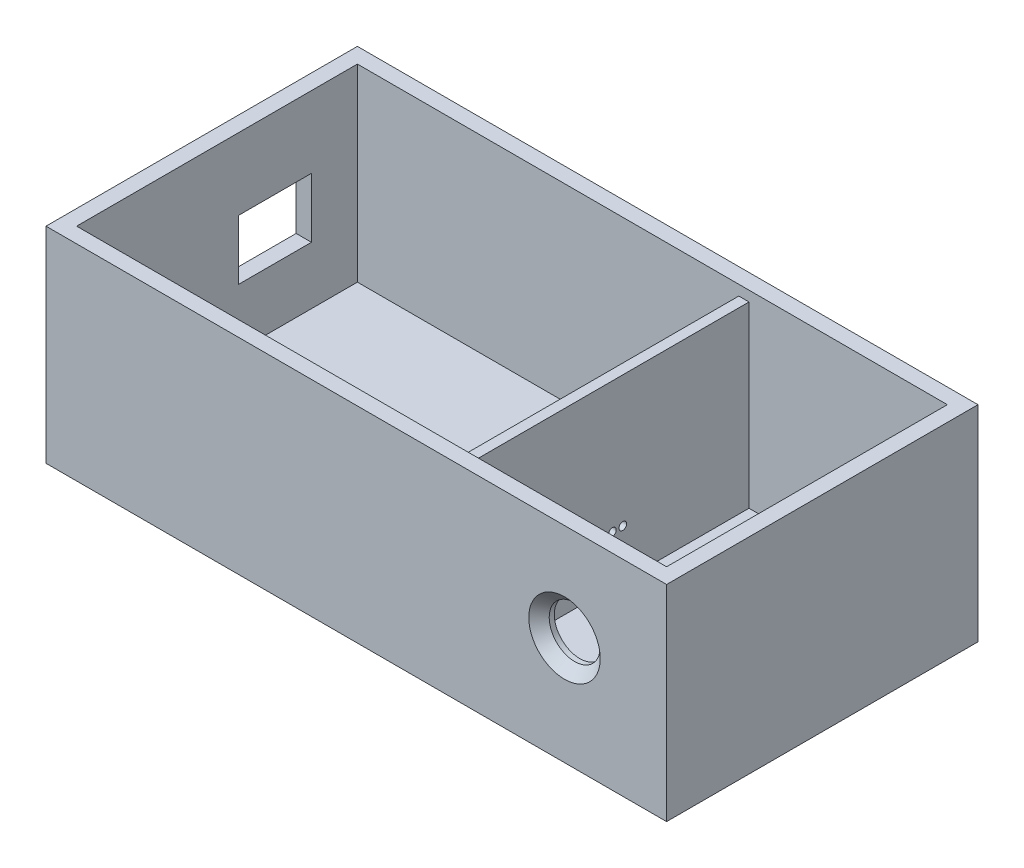
ISO-10303-21;
HEADER;
FILE_DESCRIPTION(('STEP AP214'),'2;1');
FILE_NAME('part.step','',(''),(''),'','','');
FILE_SCHEMA(('AUTOMOTIVE_DESIGN { 1 0 10303 214 1 1 1 1 }'));
ENDSEC;
DATA;
#1=APPLICATION_CONTEXT('core data for automotive mechanical design processes');
#2=APPLICATION_PROTOCOL_DEFINITION('international standard','automotive_design',2000,#1);
#3=PRODUCT_CONTEXT('',#1,'mechanical');
#4=PRODUCT('Part','Part','',(#3));
#5=PRODUCT_RELATED_PRODUCT_CATEGORY('part','',(#4));
#6=PRODUCT_DEFINITION_FORMATION('','',#4);
#7=PRODUCT_DEFINITION_CONTEXT('part definition',#1,'design');
#8=PRODUCT_DEFINITION('design','',#6,#7);
#9=PRODUCT_DEFINITION_SHAPE('','',#8);
#10=(LENGTH_UNIT() NAMED_UNIT(*) SI_UNIT(.MILLI.,.METRE.));
#11=(NAMED_UNIT(*) PLANE_ANGLE_UNIT() SI_UNIT($,.RADIAN.));
#12=(NAMED_UNIT(*) SI_UNIT($,.STERADIAN.) SOLID_ANGLE_UNIT());
#13=UNCERTAINTY_MEASURE_WITH_UNIT(LENGTH_MEASURE(1.E-05),#10,'distance_accuracy_value','');
#14=(GEOMETRIC_REPRESENTATION_CONTEXT(3) GLOBAL_UNCERTAINTY_ASSIGNED_CONTEXT((#13)) GLOBAL_UNIT_ASSIGNED_CONTEXT((#10,
#11,#12)) REPRESENTATION_CONTEXT('',''));
#15=CARTESIAN_POINT('',(0.,0.,0.));
#16=DIRECTION('',(0.,0.,1.));
#17=DIRECTION('',(1.,0.,0.));
#18=AXIS2_PLACEMENT_3D('',#15,#16,#17);
#19=CARTESIAN_POINT('',(-57.785,40.2353694330568,27.5));
#20=DIRECTION('',(0.,0.,-1.));
#21=DIRECTION('',(-1.,0.,0.));
#22=AXIS2_PLACEMENT_3D('',#19,#20,#21);
#23=PLANE('',#22);
#24=CARTESIAN_POINT('',(40.785,21.15,27.5));
#25=DIRECTION('',(0.,0.,-1.));
#26=DIRECTION('',(-1.,0.,0.));
#27=AXIS2_PLACEMENT_3D('',#24,#25,#26);
#28=CIRCLE('',#27,5.);
#29=CARTESIAN_POINT('',(35.785,21.15,27.5));
#30=VERTEX_POINT('',#29);
#31=EDGE_CURVE('E325',#30,#30,#28,.T.);
#32=ORIENTED_EDGE('',*,*,#31,.F.);
#33=EDGE_LOOP('',(#32));
#34=FACE_BOUND('',#33,.T.);
#35=DIRECTION('',(-1.,0.,0.));
#36=VECTOR('',#35,1.);
#37=CARTESIAN_POINT('',(18.9299999999998,38.2353694330568,27.5));
#38=LINE('',#37,#36);
#39=CARTESIAN_POINT('',(18.9299999999998,38.2353694330568,27.5));
#40=VERTEX_POINT('',#39);
#41=CARTESIAN_POINT('',(16.9299999999997,38.2353694330568,27.5));
#42=VERTEX_POINT('',#41);
#43=EDGE_CURVE('E302',#40,#42,#38,.T.);
#44=ORIENTED_EDGE('',*,*,#43,.T.);
#45=DIRECTION('',(0.,-1.,0.));
#46=VECTOR('',#45,1.);
#47=CARTESIAN_POINT('',(16.9299999999997,38.2353694330568,27.5));
#48=LINE('',#47,#46);
#49=CARTESIAN_POINT('',(16.9299999999997,3.23536943305684,27.5));
#50=VERTEX_POINT('',#49);
#51=EDGE_CURVE('E138',#42,#50,#48,.T.);
#52=ORIENTED_EDGE('',*,*,#51,.T.);
#53=DIRECTION('',(1.,0.,0.));
#54=VECTOR('',#53,1.);
#55=CARTESIAN_POINT('',(-57.785,3.23536943305684,27.5));
#56=LINE('',#55,#54);
#57=CARTESIAN_POINT('',(-57.785,3.23536943305684,27.5));
#58=VERTEX_POINT('',#57);
#59=EDGE_CURVE('E233',#58,#50,#56,.T.);
#60=ORIENTED_EDGE('',*,*,#59,.F.);
#61=DIRECTION('',(0.,-1.,0.));
#62=VECTOR('',#61,1.);
#63=CARTESIAN_POINT('',(-57.785,40.2353694330568,27.5));
#64=LINE('',#63,#62);
#65=CARTESIAN_POINT('',(-57.785,40.2353694330568,27.5));
#66=VERTEX_POINT('',#65);
#67=EDGE_CURVE('E215',#66,#58,#64,.T.);
#68=ORIENTED_EDGE('',*,*,#67,.F.);
#69=DIRECTION('',(1.,0.,0.));
#70=VECTOR('',#69,1.);
#71=CARTESIAN_POINT('',(-57.785,40.2353694330568,27.5));
#72=LINE('',#71,#70);
#73=CARTESIAN_POINT('',(57.785,40.2353694330568,27.5));
#74=VERTEX_POINT('',#73);
#75=EDGE_CURVE('E127',#66,#74,#72,.T.);
#76=ORIENTED_EDGE('',*,*,#75,.T.);
#77=DIRECTION('',(0.,-1.,0.));
#78=VECTOR('',#77,1.);
#79=CARTESIAN_POINT('',(57.785,40.2353694330568,27.5));
#80=LINE('',#79,#78);
#81=CARTESIAN_POINT('',(57.785,3.23536943305684,27.5));
#82=VERTEX_POINT('',#81);
#83=EDGE_CURVE('E221',#74,#82,#80,.T.);
#84=ORIENTED_EDGE('',*,*,#83,.T.);
#85=CARTESIAN_POINT('',(18.9299999999998,3.23536943305684,27.5));
#86=VERTEX_POINT('',#85);
#87=EDGE_CURVE('E240',#86,#82,#56,.T.);
#88=ORIENTED_EDGE('',*,*,#87,.F.);
#89=DIRECTION('',(0.,-1.,0.));
#90=VECTOR('',#89,1.);
#91=CARTESIAN_POINT('',(18.9299999999998,38.2353694330568,27.5));
#92=LINE('',#91,#90);
#93=EDGE_CURVE('E303',#40,#86,#92,.T.);
#94=ORIENTED_EDGE('',*,*,#93,.F.);
#95=EDGE_LOOP('',(#44,#52,#60,#68,#76,#84,#88,#94));
#96=FACE_BOUND('',#95,.T.);
#97=ADVANCED_FACE('F47',(#34,#96),#23,.T.);
#98=CARTESIAN_POINT('',(57.785,40.2353694330568,-27.5));
#99=DIRECTION('',(0.,0.,1.));
#100=DIRECTION('',(1.,0.,0.));
#101=AXIS2_PLACEMENT_3D('',#98,#99,#100);
#102=PLANE('',#101);
#103=DIRECTION('',(-1.,0.,0.));
#104=VECTOR('',#103,1.);
#105=CARTESIAN_POINT('',(57.785,3.23536943305684,-27.5));
#106=LINE('',#105,#104);
#107=CARTESIAN_POINT('',(16.9299999999997,3.23536943305684,-27.5));
#108=VERTEX_POINT('',#107);
#109=CARTESIAN_POINT('',(-57.785,3.23536943305684,-27.5));
#110=VERTEX_POINT('',#109);
#111=EDGE_CURVE('E237',#108,#110,#106,.T.);
#112=ORIENTED_EDGE('',*,*,#111,.F.);
#113=DIRECTION('',(0.,-1.,0.));
#114=VECTOR('',#113,1.);
#115=CARTESIAN_POINT('',(16.9299999999997,38.2353694330568,-27.5));
#116=LINE('',#115,#114);
#117=CARTESIAN_POINT('',(16.9299999999997,38.2353694330568,-27.5));
#118=VERTEX_POINT('',#117);
#119=EDGE_CURVE('E295',#118,#108,#116,.T.);
#120=ORIENTED_EDGE('',*,*,#119,.F.);
#121=DIRECTION('',(-1.,0.,0.));
#122=VECTOR('',#121,1.);
#123=CARTESIAN_POINT('',(18.9299999999997,38.2353694330568,-27.5));
#124=LINE('',#123,#122);
#125=CARTESIAN_POINT('',(18.9299999999998,38.2353694330568,-27.5));
#126=VERTEX_POINT('',#125);
#127=EDGE_CURVE('E307',#126,#118,#124,.T.);
#128=ORIENTED_EDGE('',*,*,#127,.F.);
#129=DIRECTION('',(0.,-1.,0.));
#130=VECTOR('',#129,1.);
#131=CARTESIAN_POINT('',(18.9299999999997,38.2353694330568,-27.5));
#132=LINE('',#131,#130);
#133=CARTESIAN_POINT('',(18.9299999999997,3.23536943305684,-27.5));
#134=VERTEX_POINT('',#133);
#135=EDGE_CURVE('E224',#126,#134,#132,.T.);
#136=ORIENTED_EDGE('',*,*,#135,.T.);
#137=CARTESIAN_POINT('',(57.785,3.23536943305684,-27.5));
#138=VERTEX_POINT('',#137);
#139=EDGE_CURVE('E101',#138,#134,#106,.T.);
#140=ORIENTED_EDGE('',*,*,#139,.F.);
#141=DIRECTION('',(0.,-1.,0.));
#142=VECTOR('',#141,1.);
#143=CARTESIAN_POINT('',(57.785,40.2353694330568,-27.5));
#144=LINE('',#143,#142);
#145=CARTESIAN_POINT('',(57.785,40.2353694330568,-27.5));
#146=VERTEX_POINT('',#145);
#147=EDGE_CURVE('E225',#146,#138,#144,.T.);
#148=ORIENTED_EDGE('',*,*,#147,.F.);
#149=DIRECTION('',(-1.,0.,0.));
#150=VECTOR('',#149,1.);
#151=CARTESIAN_POINT('',(57.785,40.2353694330568,-27.5));
#152=LINE('',#151,#150);
#153=CARTESIAN_POINT('',(-57.785,40.2353694330568,-27.5));
#154=VERTEX_POINT('',#153);
#155=EDGE_CURVE('E234',#146,#154,#152,.T.);
#156=ORIENTED_EDGE('',*,*,#155,.T.);
#157=DIRECTION('',(0.,-1.,0.));
#158=VECTOR('',#157,1.);
#159=CARTESIAN_POINT('',(-57.785,40.2353694330568,-27.5));
#160=LINE('',#159,#158);
#161=EDGE_CURVE('E229',#154,#110,#160,.T.);
#162=ORIENTED_EDGE('',*,*,#161,.T.);
#163=EDGE_LOOP('',(#112,#120,#128,#136,#140,#148,#156,#162));
#164=FACE_BOUND('',#163,.T.);
#165=ADVANCED_FACE('F420',(#164),#102,.T.);
#166=CARTESIAN_POINT('',(0.,3.23536943305684,0.));
#167=DIRECTION('',(0.,1.,0.));
#168=DIRECTION('',(0.,0.,1.));
#169=AXIS2_PLACEMENT_3D('',#166,#167,#168);
#170=PLANE('',#169);
#171=ORIENTED_EDGE('',*,*,#59,.T.);
#172=DIRECTION('',(0.,0.,1.));
#173=VECTOR('',#172,1.);
#174=CARTESIAN_POINT('',(16.9299999999997,3.23536943305684,-27.5));
#175=LINE('',#174,#173);
#176=EDGE_CURVE('E287',#108,#50,#175,.T.);
#177=ORIENTED_EDGE('',*,*,#176,.F.);
#178=ORIENTED_EDGE('',*,*,#111,.T.);
#179=DIRECTION('',(0.,0.,1.));
#180=VECTOR('',#179,1.);
#181=CARTESIAN_POINT('',(-57.785,3.23536943305684,-27.5));
#182=LINE('',#181,#180);
#183=EDGE_CURVE('E243',#110,#58,#182,.T.);
#184=ORIENTED_EDGE('',*,*,#183,.T.);
#185=EDGE_LOOP('',(#171,#177,#178,#184));
#186=FACE_BOUND('',#185,.T.);
#187=ADVANCED_FACE('F417',(#186),#170,.T.);
#188=CARTESIAN_POINT('',(60.785,3.23536943305684,-30.5));
#189=DIRECTION('',(-1.,0.,0.));
#190=DIRECTION('',(0.,0.,1.));
#191=AXIS2_PLACEMENT_3D('',#188,#189,#190);
#192=PLANE('',#191);
#193=DIRECTION('',(0.,0.,-1.));
#194=VECTOR('',#193,1.);
#195=CARTESIAN_POINT('',(60.785,0.,-30.5));
#196=LINE('',#195,#194);
#197=CARTESIAN_POINT('',(60.785,0.,30.5));
#198=VERTEX_POINT('',#197);
#199=CARTESIAN_POINT('',(60.785,0.,-30.5));
#200=VERTEX_POINT('',#199);
#201=EDGE_CURVE('E183',#198,#200,#196,.T.);
#202=ORIENTED_EDGE('',*,*,#201,.T.);
#203=DIRECTION('',(0.,-1.,0.));
#204=VECTOR('',#203,1.);
#205=CARTESIAN_POINT('',(60.785,3.23536943305684,-30.5));
#206=LINE('',#205,#204);
#207=CARTESIAN_POINT('',(60.785,40.2353694330568,-30.5));
#208=VERTEX_POINT('',#207);
#209=EDGE_CURVE('E176',#208,#200,#206,.T.);
#210=ORIENTED_EDGE('',*,*,#209,.F.);
#211=DIRECTION('',(0.,0.,-1.));
#212=VECTOR('',#211,1.);
#213=CARTESIAN_POINT('',(60.785,40.2353694330568,30.5));
#214=LINE('',#213,#212);
#215=CARTESIAN_POINT('',(60.785,40.2353694330568,30.5));
#216=VERTEX_POINT('',#215);
#217=EDGE_CURVE('E180',#216,#208,#214,.T.);
#218=ORIENTED_EDGE('',*,*,#217,.F.);
#219=DIRECTION('',(0.,-1.,0.));
#220=VECTOR('',#219,1.);
#221=CARTESIAN_POINT('',(60.785,3.23536943305684,30.5));
#222=LINE('',#221,#220);
#223=EDGE_CURVE('E375',#216,#198,#222,.T.);
#224=ORIENTED_EDGE('',*,*,#223,.T.);
#225=EDGE_LOOP('',(#202,#210,#218,#224));
#226=FACE_BOUND('',#225,.T.);
#227=ADVANCED_FACE('F178',(#226),#192,.F.);
#228=CARTESIAN_POINT('',(-60.785,3.23536943305684,-30.5));
#229=DIRECTION('',(0.,0.,1.));
#230=DIRECTION('',(1.,0.,0.));
#231=AXIS2_PLACEMENT_3D('',#228,#229,#230);
#232=PLANE('',#231);
#233=DIRECTION('',(-1.,0.,0.));
#234=VECTOR('',#233,1.);
#235=CARTESIAN_POINT('',(-60.785,0.,-30.5));
#236=LINE('',#235,#234);
#237=CARTESIAN_POINT('',(-60.785,0.,-30.5));
#238=VERTEX_POINT('',#237);
#239=EDGE_CURVE('E188',#200,#238,#236,.T.);
#240=ORIENTED_EDGE('',*,*,#239,.T.);
#241=DIRECTION('',(0.,-1.,0.));
#242=VECTOR('',#241,1.);
#243=CARTESIAN_POINT('',(-60.785,3.23536943305684,-30.5));
#244=LINE('',#243,#242);
#245=CARTESIAN_POINT('',(-60.785,40.2353694330568,-30.5));
#246=VERTEX_POINT('',#245);
#247=EDGE_CURVE('E203',#246,#238,#244,.T.);
#248=ORIENTED_EDGE('',*,*,#247,.F.);
#249=DIRECTION('',(-1.,0.,0.));
#250=VECTOR('',#249,1.);
#251=CARTESIAN_POINT('',(60.785,40.2353694330568,-30.5));
#252=LINE('',#251,#250);
#253=EDGE_CURVE('E195',#208,#246,#252,.T.);
#254=ORIENTED_EDGE('',*,*,#253,.F.);
#255=ORIENTED_EDGE('',*,*,#209,.T.);
#256=EDGE_LOOP('',(#240,#248,#254,#255));
#257=FACE_BOUND('',#256,.T.);
#258=ADVANCED_FACE('F201',(#257),#232,.F.);
#259=CARTESIAN_POINT('',(-60.785,3.23536943305684,-30.5));
#260=DIRECTION('',(1.,0.,0.));
#261=DIRECTION('',(0.,0.,-1.));
#262=AXIS2_PLACEMENT_3D('',#259,#260,#261);
#263=PLANE('',#262);
#264=DIRECTION('',(0.,0.,-1.));
#265=VECTOR('',#264,1.);
#266=CARTESIAN_POINT('',(-60.785,26.2,-18.5));
#267=LINE('',#266,#265);
#268=CARTESIAN_POINT('',(-60.785,26.2,-4.2));
#269=VERTEX_POINT('',#268);
#270=CARTESIAN_POINT('',(-60.785,26.2,-18.5));
#271=VERTEX_POINT('',#270);
#272=EDGE_CURVE('E260',#269,#271,#267,.T.);
#273=ORIENTED_EDGE('',*,*,#272,.F.);
#274=DIRECTION('',(0.,1.,0.));
#275=VECTOR('',#274,1.);
#276=CARTESIAN_POINT('',(-60.785,14.5,-4.2));
#277=LINE('',#276,#275);
#278=CARTESIAN_POINT('',(-60.785,14.5,-4.2));
#279=VERTEX_POINT('',#278);
#280=EDGE_CURVE('E269',#279,#269,#277,.T.);
#281=ORIENTED_EDGE('',*,*,#280,.F.);
#282=DIRECTION('',(0.,0.,1.));
#283=VECTOR('',#282,1.);
#284=CARTESIAN_POINT('',(-60.785,14.5,-18.5));
#285=LINE('',#284,#283);
#286=CARTESIAN_POINT('',(-60.785,14.5,-18.5));
#287=VERTEX_POINT('',#286);
#288=EDGE_CURVE('E265',#287,#279,#285,.T.);
#289=ORIENTED_EDGE('',*,*,#288,.F.);
#290=DIRECTION('',(0.,-1.,0.));
#291=VECTOR('',#290,1.);
#292=CARTESIAN_POINT('',(-60.785,14.5,-18.5));
#293=LINE('',#292,#291);
#294=EDGE_CURVE('E261',#271,#287,#293,.T.);
#295=ORIENTED_EDGE('',*,*,#294,.F.);
#296=EDGE_LOOP('',(#273,#281,#289,#295));
#297=FACE_BOUND('',#296,.T.);
#298=DIRECTION('',(0.,0.,1.));
#299=VECTOR('',#298,1.);
#300=CARTESIAN_POINT('',(-60.785,0.,-30.5));
#301=LINE('',#300,#299);
#302=CARTESIAN_POINT('',(-60.785,0.,30.5));
#303=VERTEX_POINT('',#302);
#304=EDGE_CURVE('E187',#238,#303,#301,.T.);
#305=ORIENTED_EDGE('',*,*,#304,.T.);
#306=DIRECTION('',(0.,-1.,0.));
#307=VECTOR('',#306,1.);
#308=CARTESIAN_POINT('',(-60.785,3.23536943305684,30.5));
#309=LINE('',#308,#307);
#310=CARTESIAN_POINT('',(-60.785,40.2353694330568,30.5));
#311=VERTEX_POINT('',#310);
#312=EDGE_CURVE('E214',#311,#303,#309,.T.);
#313=ORIENTED_EDGE('',*,*,#312,.F.);
#314=DIRECTION('',(0.,0.,1.));
#315=VECTOR('',#314,1.);
#316=CARTESIAN_POINT('',(-60.785,40.2353694330568,-30.5));
#317=LINE('',#316,#315);
#318=EDGE_CURVE('E205',#246,#311,#317,.T.);
#319=ORIENTED_EDGE('',*,*,#318,.F.);
#320=ORIENTED_EDGE('',*,*,#247,.T.);
#321=EDGE_LOOP('',(#305,#313,#319,#320));
#322=FACE_BOUND('',#321,.T.);
#323=ADVANCED_FACE('F464',(#297,#322),#263,.F.);
#324=CARTESIAN_POINT('',(-60.785,3.23536943305684,30.5));
#325=DIRECTION('',(0.,0.,-1.));
#326=DIRECTION('',(-1.,0.,0.));
#327=AXIS2_PLACEMENT_3D('',#324,#325,#326);
#328=PLANE('',#327);
#329=CARTESIAN_POINT('',(40.785,21.15,30.5));
#330=DIRECTION('',(0.,0.,-1.));
#331=DIRECTION('',(-1.,0.,0.));
#332=AXIS2_PLACEMENT_3D('',#329,#330,#331);
#333=CIRCLE('',#332,6.99999999999998);
#334=CARTESIAN_POINT('',(33.785,21.15,30.5));
#335=VERTEX_POINT('',#334);
#336=EDGE_CURVE('E11',#335,#335,#333,.T.);
#337=ORIENTED_EDGE('',*,*,#336,.T.);
#338=EDGE_LOOP('',(#337));
#339=FACE_BOUND('',#338,.T.);
#340=DIRECTION('',(1.,0.,0.));
#341=VECTOR('',#340,1.);
#342=CARTESIAN_POINT('',(-60.785,0.,30.5));
#343=LINE('',#342,#341);
#344=EDGE_CURVE('E371',#303,#198,#343,.T.);
#345=ORIENTED_EDGE('',*,*,#344,.T.);
#346=ORIENTED_EDGE('',*,*,#223,.F.);
#347=DIRECTION('',(1.,0.,0.));
#348=VECTOR('',#347,1.);
#349=CARTESIAN_POINT('',(-60.785,40.2353694330568,30.5));
#350=LINE('',#349,#348);
#351=EDGE_CURVE('E198',#311,#216,#350,.T.);
#352=ORIENTED_EDGE('',*,*,#351,.F.);
#353=ORIENTED_EDGE('',*,*,#312,.T.);
#354=EDGE_LOOP('',(#345,#346,#352,#353));
#355=FACE_BOUND('',#354,.T.);
#356=ADVANCED_FACE('F460',(#339,#355),#328,.F.);
#357=CARTESIAN_POINT('',(0.,0.,0.));
#358=DIRECTION('',(0.,1.,0.));
#359=DIRECTION('',(0.,0.,1.));
#360=AXIS2_PLACEMENT_3D('',#357,#358,#359);
#361=PLANE('',#360);
#362=ORIENTED_EDGE('',*,*,#201,.F.);
#363=ORIENTED_EDGE('',*,*,#344,.F.);
#364=ORIENTED_EDGE('',*,*,#304,.F.);
#365=ORIENTED_EDGE('',*,*,#239,.F.);
#366=EDGE_LOOP('',(#362,#363,#364,#365));
#367=FACE_BOUND('',#366,.T.);
#368=ADVANCED_FACE('F463',(#367),#361,.F.);
#369=CARTESIAN_POINT('',(0.,40.2353694330568,0.));
#370=DIRECTION('',(0.,1.,0.));
#371=DIRECTION('',(0.,0.,1.));
#372=AXIS2_PLACEMENT_3D('',#369,#370,#371);
#373=PLANE('',#372);
#374=ORIENTED_EDGE('',*,*,#351,.T.);
#375=ORIENTED_EDGE('',*,*,#217,.T.);
#376=ORIENTED_EDGE('',*,*,#253,.T.);
#377=ORIENTED_EDGE('',*,*,#318,.T.);
#378=EDGE_LOOP('',(#374,#375,#376,#377));
#379=FACE_BOUND('',#378,.T.);
#380=ORIENTED_EDGE('',*,*,#75,.F.);
#381=DIRECTION('',(0.,0.,1.));
#382=VECTOR('',#381,1.);
#383=CARTESIAN_POINT('',(-57.785,40.2353694330568,-27.5));
#384=LINE('',#383,#382);
#385=EDGE_CURVE('E220',#154,#66,#384,.T.);
#386=ORIENTED_EDGE('',*,*,#385,.F.);
#387=ORIENTED_EDGE('',*,*,#155,.F.);
#388=DIRECTION('',(0.,0.,-1.));
#389=VECTOR('',#388,1.);
#390=CARTESIAN_POINT('',(57.785,40.2353694330568,27.5));
#391=LINE('',#390,#389);
#392=EDGE_CURVE('E219',#74,#146,#391,.T.);
#393=ORIENTED_EDGE('',*,*,#392,.F.);
#394=EDGE_LOOP('',(#380,#386,#387,#393));
#395=FACE_BOUND('',#394,.T.);
#396=ADVANCED_FACE('F192',(#379,#395),#373,.T.);
#397=CARTESIAN_POINT('',(-57.785,40.2353694330568,-27.5));
#398=DIRECTION('',(1.,0.,0.));
#399=DIRECTION('',(0.,0.,-1.));
#400=AXIS2_PLACEMENT_3D('',#397,#398,#399);
#401=PLANE('',#400);
#402=DIRECTION('',(0.,1.,0.));
#403=VECTOR('',#402,1.);
#404=CARTESIAN_POINT('',(-57.785,14.5,-4.2));
#405=LINE('',#404,#403);
#406=CARTESIAN_POINT('',(-57.785,14.5,-4.2));
#407=VERTEX_POINT('',#406);
#408=CARTESIAN_POINT('',(-57.785,26.2,-4.2));
#409=VERTEX_POINT('',#408);
#410=EDGE_CURVE('E208',#407,#409,#405,.T.);
#411=ORIENTED_EDGE('',*,*,#410,.T.);
#412=DIRECTION('',(0.,0.,-1.));
#413=VECTOR('',#412,1.);
#414=CARTESIAN_POINT('',(-57.785,26.2,-18.5));
#415=LINE('',#414,#413);
#416=CARTESIAN_POINT('',(-57.785,26.2,-18.5));
#417=VERTEX_POINT('',#416);
#418=EDGE_CURVE('E68',#409,#417,#415,.T.);
#419=ORIENTED_EDGE('',*,*,#418,.T.);
#420=DIRECTION('',(0.,-1.,0.));
#421=VECTOR('',#420,1.);
#422=CARTESIAN_POINT('',(-57.785,14.5,-18.5));
#423=LINE('',#422,#421);
#424=CARTESIAN_POINT('',(-57.785,14.5,-18.5));
#425=VERTEX_POINT('',#424);
#426=EDGE_CURVE('E272',#417,#425,#423,.T.);
#427=ORIENTED_EDGE('',*,*,#426,.T.);
#428=DIRECTION('',(0.,0.,1.));
#429=VECTOR('',#428,1.);
#430=CARTESIAN_POINT('',(-57.785,14.5,-18.5));
#431=LINE('',#430,#429);
#432=EDGE_CURVE('E256',#425,#407,#431,.T.);
#433=ORIENTED_EDGE('',*,*,#432,.T.);
#434=EDGE_LOOP('',(#411,#419,#427,#433));
#435=FACE_BOUND('',#434,.T.);
#436=ORIENTED_EDGE('',*,*,#183,.F.);
#437=ORIENTED_EDGE('',*,*,#161,.F.);
#438=ORIENTED_EDGE('',*,*,#385,.T.);
#439=ORIENTED_EDGE('',*,*,#67,.T.);
#440=EDGE_LOOP('',(#436,#437,#438,#439));
#441=FACE_BOUND('',#440,.T.);
#442=ADVANCED_FACE('F426',(#435,#441),#401,.T.);
#443=CARTESIAN_POINT('',(57.785,40.2353694330568,27.5));
#444=DIRECTION('',(-1.,0.,0.));
#445=DIRECTION('',(0.,0.,1.));
#446=AXIS2_PLACEMENT_3D('',#443,#444,#445);
#447=PLANE('',#446);
#448=DIRECTION('',(0.,0.,-1.));
#449=VECTOR('',#448,1.);
#450=CARTESIAN_POINT('',(57.785,3.23536943305684,27.5));
#451=LINE('',#450,#449);
#452=EDGE_CURVE('E107',#82,#138,#451,.T.);
#453=ORIENTED_EDGE('',*,*,#452,.F.);
#454=ORIENTED_EDGE('',*,*,#83,.F.);
#455=ORIENTED_EDGE('',*,*,#392,.T.);
#456=ORIENTED_EDGE('',*,*,#147,.T.);
#457=EDGE_LOOP('',(#453,#454,#455,#456));
#458=FACE_BOUND('',#457,.T.);
#459=ADVANCED_FACE('F441',(#458),#447,.T.);
#460=DIRECTION('',(0.,0.,1.));
#461=VECTOR('',#460,1.);
#462=CARTESIAN_POINT('',(18.9299999999997,3.23536943305684,-27.5));
#463=LINE('',#462,#461);
#464=EDGE_CURVE('E228',#134,#86,#463,.T.);
#465=ORIENTED_EDGE('',*,*,#464,.T.);
#466=ORIENTED_EDGE('',*,*,#87,.T.);
#467=ORIENTED_EDGE('',*,*,#452,.T.);
#468=ORIENTED_EDGE('',*,*,#139,.T.);
#469=EDGE_LOOP('',(#465,#466,#467,#468));
#470=FACE_BOUND('',#469,.T.);
#471=ADVANCED_FACE('F430',(#470),#170,.T.);
#472=CARTESIAN_POINT('',(60.786,14.5,-4.20000000000002));
#473=DIRECTION('',(0.,0.,1.));
#474=DIRECTION('',(1.,0.,0.));
#475=AXIS2_PLACEMENT_3D('',#472,#473,#474);
#476=PLANE('',#475);
#477=DIRECTION('',(-1.,0.,0.));
#478=VECTOR('',#477,1.);
#479=CARTESIAN_POINT('',(60.786,14.5,-4.20000000000002));
#480=LINE('',#479,#478);
#481=EDGE_CURVE('E92',#407,#279,#480,.T.);
#482=ORIENTED_EDGE('',*,*,#481,.T.);
#483=ORIENTED_EDGE('',*,*,#280,.T.);
#484=DIRECTION('',(-1.,0.,0.));
#485=VECTOR('',#484,1.);
#486=CARTESIAN_POINT('',(60.786,26.2,-4.20000000000002));
#487=LINE('',#486,#485);
#488=EDGE_CURVE('E257',#409,#269,#487,.T.);
#489=ORIENTED_EDGE('',*,*,#488,.F.);
#490=ORIENTED_EDGE('',*,*,#410,.F.);
#491=EDGE_LOOP('',(#482,#483,#489,#490));
#492=FACE_BOUND('',#491,.T.);
#493=ADVANCED_FACE('F448',(#492),#476,.F.);
#494=CARTESIAN_POINT('',(60.786,14.5,-18.5));
#495=DIRECTION('',(0.,-1.,0.));
#496=DIRECTION('',(0.,0.,-1.));
#497=AXIS2_PLACEMENT_3D('',#494,#495,#496);
#498=PLANE('',#497);
#499=DIRECTION('',(-1.,0.,0.));
#500=VECTOR('',#499,1.);
#501=CARTESIAN_POINT('',(60.786,14.5,-18.5));
#502=LINE('',#501,#500);
#503=EDGE_CURVE('E266',#425,#287,#502,.T.);
#504=ORIENTED_EDGE('',*,*,#503,.T.);
#505=ORIENTED_EDGE('',*,*,#288,.T.);
#506=ORIENTED_EDGE('',*,*,#481,.F.);
#507=ORIENTED_EDGE('',*,*,#432,.F.);
#508=EDGE_LOOP('',(#504,#505,#506,#507));
#509=FACE_BOUND('',#508,.T.);
#510=ADVANCED_FACE('F479',(#509),#498,.F.);
#511=CARTESIAN_POINT('',(60.786,14.5,-18.5));
#512=DIRECTION('',(0.,0.,-1.));
#513=DIRECTION('',(0.,1.,0.));
#514=AXIS2_PLACEMENT_3D('',#511,#512,#513);
#515=PLANE('',#514);
#516=DIRECTION('',(-1.,0.,0.));
#517=VECTOR('',#516,1.);
#518=CARTESIAN_POINT('',(60.786,26.2,-18.5));
#519=LINE('',#518,#517);
#520=EDGE_CURVE('E262',#417,#271,#519,.T.);
#521=ORIENTED_EDGE('',*,*,#520,.T.);
#522=ORIENTED_EDGE('',*,*,#294,.T.);
#523=ORIENTED_EDGE('',*,*,#503,.F.);
#524=ORIENTED_EDGE('',*,*,#426,.F.);
#525=EDGE_LOOP('',(#521,#522,#523,#524));
#526=FACE_BOUND('',#525,.T.);
#527=ADVANCED_FACE('F476',(#526),#515,.F.);
#528=CARTESIAN_POINT('',(60.786,26.2,-18.5));
#529=DIRECTION('',(0.,1.,0.));
#530=DIRECTION('',(0.,0.,1.));
#531=AXIS2_PLACEMENT_3D('',#528,#529,#530);
#532=PLANE('',#531);
#533=ORIENTED_EDGE('',*,*,#488,.T.);
#534=ORIENTED_EDGE('',*,*,#272,.T.);
#535=ORIENTED_EDGE('',*,*,#520,.F.);
#536=ORIENTED_EDGE('',*,*,#418,.F.);
#537=EDGE_LOOP('',(#533,#534,#535,#536));
#538=FACE_BOUND('',#537,.T.);
#539=ADVANCED_FACE('F401',(#538),#532,.F.);
#540=CARTESIAN_POINT('',(16.9299999999997,38.2353694330568,-27.5));
#541=DIRECTION('',(1.,0.,0.));
#542=DIRECTION('',(0.,0.,-1.));
#543=AXIS2_PLACEMENT_3D('',#540,#541,#542);
#544=PLANE('',#543);
#545=CARTESIAN_POINT('',(16.9299999999997,12.5791882568365,1.27847670078651));
#546=DIRECTION('',(1.,0.,0.));
#547=DIRECTION('',(0.,0.,-1.));
#548=AXIS2_PLACEMENT_3D('',#545,#546,#547);
#549=CIRCLE('',#548,0.750000000033241);
#550=CARTESIAN_POINT('',(16.9299999999997,12.5791882568365,0.528476700753274));
#551=VERTEX_POINT('',#550);
#552=EDGE_CURVE('E320',#551,#551,#549,.F.);
#553=ORIENTED_EDGE('',*,*,#552,.F.);
#554=EDGE_LOOP('',(#553));
#555=FACE_BOUND('',#554,.T.);
#556=CARTESIAN_POINT('',(16.9299999999997,12.5791882568365,3.44541986027247));
#557=DIRECTION('',(1.,0.,0.));
#558=DIRECTION('',(0.,0.,-1.));
#559=AXIS2_PLACEMENT_3D('',#556,#557,#558);
#560=CIRCLE('',#559,0.750000000049859);
#561=CARTESIAN_POINT('',(16.9299999999997,12.5791882568365,2.69541986022261));
#562=VERTEX_POINT('',#561);
#563=EDGE_CURVE('E352',#562,#562,#560,.F.);
#564=ORIENTED_EDGE('',*,*,#563,.F.);
#565=EDGE_LOOP('',(#564));
#566=FACE_BOUND('',#565,.T.);
#567=CARTESIAN_POINT('',(16.9299999999997,12.5791882568365,5.769363075387));
#568=DIRECTION('',(1.,0.,0.));
#569=DIRECTION('',(0.,0.,-1.));
#570=AXIS2_PLACEMENT_3D('',#567,#568,#569);
#571=CIRCLE('',#570,0.750000000033241);
#572=CARTESIAN_POINT('',(16.9299999999997,12.5791882568365,5.01936307535376));
#573=VERTEX_POINT('',#572);
#574=EDGE_CURVE('E348',#573,#573,#571,.F.);
#575=ORIENTED_EDGE('',*,*,#574,.F.);
#576=EDGE_LOOP('',(#575));
#577=FACE_BOUND('',#576,.T.);
#578=CARTESIAN_POINT('',(16.9299999999997,12.5791882568365,-2.77429940213336));
#579=DIRECTION('',(1.,0.,0.));
#580=DIRECTION('',(0.,0.,-1.));
#581=AXIS2_PLACEMENT_3D('',#578,#579,#580);
#582=CIRCLE('',#581,0.75000000004986);
#583=CARTESIAN_POINT('',(16.9299999999997,12.5791882568365,-3.52429940218322));
#584=VERTEX_POINT('',#583);
#585=EDGE_CURVE('E344',#584,#584,#582,.F.);
#586=ORIENTED_EDGE('',*,*,#585,.F.);
#587=EDGE_LOOP('',(#586));
#588=FACE_BOUND('',#587,.T.);
#589=CARTESIAN_POINT('',(16.9299999999997,12.5791882568365,-0.737087905696485));
#590=DIRECTION('',(1.,0.,0.));
#591=DIRECTION('',(0.,0.,-1.));
#592=AXIS2_PLACEMENT_3D('',#589,#590,#591);
#593=CIRCLE('',#592,0.75);
#594=CARTESIAN_POINT('',(16.9299999999997,12.5791882568365,-1.48708790569649));
#595=VERTEX_POINT('',#594);
#596=EDGE_CURVE('E339',#595,#595,#593,.F.);
#597=ORIENTED_EDGE('',*,*,#596,.F.);
#598=EDGE_LOOP('',(#597));
#599=FACE_BOUND('',#598,.T.);
#600=ORIENTED_EDGE('',*,*,#176,.T.);
#601=ORIENTED_EDGE('',*,*,#51,.F.);
#602=DIRECTION('',(0.,0.,1.));
#603=VECTOR('',#602,1.);
#604=CARTESIAN_POINT('',(16.9299999999997,38.2353694330568,-27.5));
#605=LINE('',#604,#603);
#606=EDGE_CURVE('E321',#118,#42,#605,.T.);
#607=ORIENTED_EDGE('',*,*,#606,.F.);
#608=ORIENTED_EDGE('',*,*,#119,.T.);
#609=EDGE_LOOP('',(#600,#601,#607,#608));
#610=FACE_BOUND('',#609,.T.);
#611=ADVANCED_FACE('F398',(#555,#566,#577,#588,#599,#610),#544,.F.);
#612=CARTESIAN_POINT('',(18.9299999999997,38.2353694330568,-27.5));
#613=DIRECTION('',(1.,0.,0.));
#614=DIRECTION('',(0.,0.,-1.));
#615=AXIS2_PLACEMENT_3D('',#612,#613,#614);
#616=PLANE('',#615);
#617=CARTESIAN_POINT('',(18.9299999999997,12.5791882568365,1.27847670078652));
#618=DIRECTION('',(1.,0.,0.));
#619=DIRECTION('',(0.,0.,-1.));
#620=AXIS2_PLACEMENT_3D('',#617,#618,#619);
#621=CIRCLE('',#620,0.750000000033241);
#622=CARTESIAN_POINT('',(18.9299999999997,12.5791882568365,0.528476700753275));
#623=VERTEX_POINT('',#622);
#624=EDGE_CURVE('E52',#623,#623,#621,.F.);
#625=ORIENTED_EDGE('',*,*,#624,.T.);
#626=EDGE_LOOP('',(#625));
#627=FACE_BOUND('',#626,.T.);
#628=CARTESIAN_POINT('',(18.9299999999997,12.5791882568365,3.44541986027247));
#629=DIRECTION('',(1.,0.,0.));
#630=DIRECTION('',(0.,0.,-1.));
#631=AXIS2_PLACEMENT_3D('',#628,#629,#630);
#632=CIRCLE('',#631,0.750000000049859);
#633=CARTESIAN_POINT('',(18.9299999999997,12.5791882568365,2.69541986022261));
#634=VERTEX_POINT('',#633);
#635=EDGE_CURVE('E349',#634,#634,#632,.F.);
#636=ORIENTED_EDGE('',*,*,#635,.T.);
#637=EDGE_LOOP('',(#636));
#638=FACE_BOUND('',#637,.T.);
#639=CARTESIAN_POINT('',(18.9299999999997,12.5791882568365,5.769363075387));
#640=DIRECTION('',(1.,0.,0.));
#641=DIRECTION('',(0.,0.,-1.));
#642=AXIS2_PLACEMENT_3D('',#639,#640,#641);
#643=CIRCLE('',#642,0.750000000033241);
#644=CARTESIAN_POINT('',(18.9299999999997,12.5791882568365,5.01936307535376));
#645=VERTEX_POINT('',#644);
#646=EDGE_CURVE('E345',#645,#645,#643,.F.);
#647=ORIENTED_EDGE('',*,*,#646,.T.);
#648=EDGE_LOOP('',(#647));
#649=FACE_BOUND('',#648,.T.);
#650=CARTESIAN_POINT('',(18.9299999999997,12.5791882568365,-2.77429940213336));
#651=DIRECTION('',(1.,0.,0.));
#652=DIRECTION('',(0.,0.,-1.));
#653=AXIS2_PLACEMENT_3D('',#650,#651,#652);
#654=CIRCLE('',#653,0.75000000004986);
#655=CARTESIAN_POINT('',(18.9299999999997,12.5791882568365,-3.52429940218322));
#656=VERTEX_POINT('',#655);
#657=EDGE_CURVE('E340',#656,#656,#654,.F.);
#658=ORIENTED_EDGE('',*,*,#657,.T.);
#659=EDGE_LOOP('',(#658));
#660=FACE_BOUND('',#659,.T.);
#661=CARTESIAN_POINT('',(18.9299999999997,12.5791882568365,-0.737087905696485));
#662=DIRECTION('',(1.,0.,0.));
#663=DIRECTION('',(0.,0.,-1.));
#664=AXIS2_PLACEMENT_3D('',#661,#662,#663);
#665=CIRCLE('',#664,0.75);
#666=CARTESIAN_POINT('',(18.9299999999997,12.5791882568365,-1.48708790569649));
#667=VERTEX_POINT('',#666);
#668=EDGE_CURVE('E335',#667,#667,#665,.F.);
#669=ORIENTED_EDGE('',*,*,#668,.T.);
#670=EDGE_LOOP('',(#669));
#671=FACE_BOUND('',#670,.T.);
#672=ORIENTED_EDGE('',*,*,#464,.F.);
#673=ORIENTED_EDGE('',*,*,#135,.F.);
#674=DIRECTION('',(0.,0.,1.));
#675=VECTOR('',#674,1.);
#676=CARTESIAN_POINT('',(18.9299999999997,38.2353694330568,-27.5));
#677=LINE('',#676,#675);
#678=EDGE_CURVE('E299',#126,#40,#677,.T.);
#679=ORIENTED_EDGE('',*,*,#678,.T.);
#680=ORIENTED_EDGE('',*,*,#93,.T.);
#681=EDGE_LOOP('',(#672,#673,#679,#680));
#682=FACE_BOUND('',#681,.T.);
#683=ADVANCED_FACE('F389',(#627,#638,#649,#660,#671,#682),#616,.T.);
#684=CARTESIAN_POINT('',(0.,38.2353694330568,0.));
#685=DIRECTION('',(0.,1.,0.));
#686=DIRECTION('',(0.,0.,1.));
#687=AXIS2_PLACEMENT_3D('',#684,#685,#686);
#688=PLANE('',#687);
#689=ORIENTED_EDGE('',*,*,#127,.T.);
#690=ORIENTED_EDGE('',*,*,#606,.T.);
#691=ORIENTED_EDGE('',*,*,#43,.F.);
#692=ORIENTED_EDGE('',*,*,#678,.F.);
#693=EDGE_LOOP('',(#689,#690,#691,#692));
#694=FACE_BOUND('',#693,.T.);
#695=ADVANCED_FACE('F437',(#694),#688,.T.);
#696=CARTESIAN_POINT('',(40.785,21.15,10.5));
#697=DIRECTION('',(0.,0.,1.));
#698=DIRECTION('',(1.,0.,0.));
#699=AXIS2_PLACEMENT_3D('',#696,#697,#698);
#700=CYLINDRICAL_SURFACE('',#699,5.);
#701=CARTESIAN_POINT('',(40.785,21.15,28.5));
#702=DIRECTION('',(0.,0.,-1.));
#703=DIRECTION('',(-1.,0.,0.));
#704=AXIS2_PLACEMENT_3D('',#701,#702,#703);
#705=CIRCLE('',#704,5.);
#706=CARTESIAN_POINT('',(35.785,21.15,28.5));
#707=VERTEX_POINT('',#706);
#708=EDGE_CURVE('E59',#707,#707,#705,.F.);
#709=ORIENTED_EDGE('',*,*,#708,.T.);
#710=EDGE_LOOP('',(#709));
#711=FACE_BOUND('',#710,.T.);
#712=ORIENTED_EDGE('',*,*,#31,.T.);
#713=EDGE_LOOP('',(#712));
#714=FACE_BOUND('',#713,.T.);
#715=ADVANCED_FACE('F466',(#711,#714),#700,.F.);
#716=CARTESIAN_POINT('',(40.785,21.15,28.5));
#717=DIRECTION('',(0.,0.,1.));
#718=DIRECTION('',(1.,0.,0.));
#719=AXIS2_PLACEMENT_3D('',#716,#717,#718);
#720=CONICAL_SURFACE('',#719,5.,0.785398163397451);
#721=ORIENTED_EDGE('',*,*,#336,.F.);
#722=EDGE_LOOP('',(#721));
#723=FACE_BOUND('',#722,.T.);
#724=ORIENTED_EDGE('',*,*,#708,.F.);
#725=EDGE_LOOP('',(#724));
#726=FACE_BOUND('',#725,.T.);
#727=ADVANCED_FACE('F50',(#723,#726),#720,.F.);
#728=CARTESIAN_POINT('',(5.92999999999972,12.5791882568365,-0.737087905696487));
#729=DIRECTION('',(1.,0.,0.));
#730=DIRECTION('',(0.,0.,-1.));
#731=AXIS2_PLACEMENT_3D('',#728,#729,#730);
#732=CYLINDRICAL_SURFACE('',#731,0.75);
#733=ORIENTED_EDGE('',*,*,#668,.F.);
#734=EDGE_LOOP('',(#733));
#735=FACE_BOUND('',#734,.T.);
#736=ORIENTED_EDGE('',*,*,#596,.T.);
#737=EDGE_LOOP('',(#736));
#738=FACE_BOUND('',#737,.T.);
#739=ADVANCED_FACE('F528',(#735,#738),#732,.F.);
#740=CARTESIAN_POINT('',(5.92999999999972,12.5791882568365,-2.77429940213336));
#741=DIRECTION('',(1.,0.,0.));
#742=DIRECTION('',(0.,0.,-1.));
#743=AXIS2_PLACEMENT_3D('',#740,#741,#742);
#744=CYLINDRICAL_SURFACE('',#743,0.75000000004986);
#745=ORIENTED_EDGE('',*,*,#657,.F.);
#746=EDGE_LOOP('',(#745));
#747=FACE_BOUND('',#746,.T.);
#748=ORIENTED_EDGE('',*,*,#585,.T.);
#749=EDGE_LOOP('',(#748));
#750=FACE_BOUND('',#749,.T.);
#751=ADVANCED_FACE('F545',(#747,#750),#744,.F.);
#752=CARTESIAN_POINT('',(5.92999999999972,12.5791882568365,5.769363075387));
#753=DIRECTION('',(1.,0.,0.));
#754=DIRECTION('',(0.,0.,-1.));
#755=AXIS2_PLACEMENT_3D('',#752,#753,#754);
#756=CYLINDRICAL_SURFACE('',#755,0.750000000033241);
#757=ORIENTED_EDGE('',*,*,#646,.F.);
#758=EDGE_LOOP('',(#757));
#759=FACE_BOUND('',#758,.T.);
#760=ORIENTED_EDGE('',*,*,#574,.T.);
#761=EDGE_LOOP('',(#760));
#762=FACE_BOUND('',#761,.T.);
#763=ADVANCED_FACE('F554',(#759,#762),#756,.F.);
#764=CARTESIAN_POINT('',(5.92999999999972,12.5791882568365,3.44541986027247));
#765=DIRECTION('',(1.,0.,0.));
#766=DIRECTION('',(0.,0.,-1.));
#767=AXIS2_PLACEMENT_3D('',#764,#765,#766);
#768=CYLINDRICAL_SURFACE('',#767,0.750000000049859);
#769=ORIENTED_EDGE('',*,*,#635,.F.);
#770=EDGE_LOOP('',(#769));
#771=FACE_BOUND('',#770,.T.);
#772=ORIENTED_EDGE('',*,*,#563,.T.);
#773=EDGE_LOOP('',(#772));
#774=FACE_BOUND('',#773,.T.);
#775=ADVANCED_FACE('F394',(#771,#774),#768,.F.);
#776=CARTESIAN_POINT('',(5.92999999999972,12.5791882568365,1.27847670078651));
#777=DIRECTION('',(1.,0.,0.));
#778=DIRECTION('',(0.,0.,-1.));
#779=AXIS2_PLACEMENT_3D('',#776,#777,#778);
#780=CYLINDRICAL_SURFACE('',#779,0.750000000033241);
#781=ORIENTED_EDGE('',*,*,#624,.F.);
#782=EDGE_LOOP('',(#781));
#783=FACE_BOUND('',#782,.T.);
#784=ORIENTED_EDGE('',*,*,#552,.T.);
#785=EDGE_LOOP('',(#784));
#786=FACE_BOUND('',#785,.T.);
#787=ADVANCED_FACE('F391',(#783,#786),#780,.F.);
#788=CLOSED_SHELL('',(#97,#165,#187,#227,#258,#323,#356,#368,#396,#442,#459,#471,#493,#510,#527,
#539,#611,#683,#695,#715,#727,#739,#751,#763,#775,#787));
#789=MANIFOLD_SOLID_BREP('B2',#788);
#790=ADVANCED_BREP_SHAPE_REPRESENTATION('',(#18,#789),#14);
#791=SHAPE_DEFINITION_REPRESENTATION(#9,#790);
ENDSEC;
END-ISO-10303-21;
